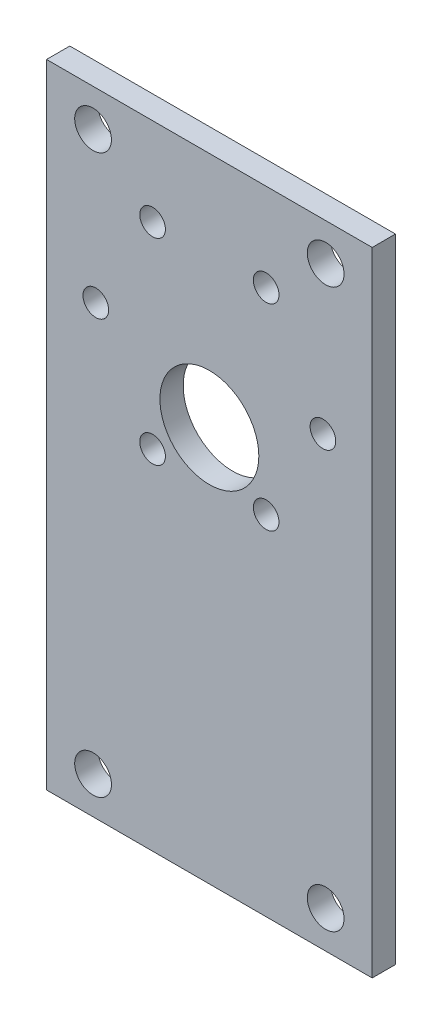
ISO-10303-21;
HEADER;
FILE_DESCRIPTION(('STEP AP214'),'2;1');
FILE_NAME('part.step','',(''),(''),'','','');
FILE_SCHEMA(('AUTOMOTIVE_DESIGN { 1 0 10303 214 1 1 1 1 }'));
ENDSEC;
DATA;
#1=APPLICATION_CONTEXT('core data for automotive mechanical design processes');
#2=APPLICATION_PROTOCOL_DEFINITION('international standard','automotive_design',2000,#1);
#3=PRODUCT_CONTEXT('',#1,'mechanical');
#4=PRODUCT('Part','Part','',(#3));
#5=PRODUCT_RELATED_PRODUCT_CATEGORY('part','',(#4));
#6=PRODUCT_DEFINITION_FORMATION('','',#4);
#7=PRODUCT_DEFINITION_CONTEXT('part definition',#1,'design');
#8=PRODUCT_DEFINITION('design','',#6,#7);
#9=PRODUCT_DEFINITION_SHAPE('','',#8);
#10=(LENGTH_UNIT() NAMED_UNIT(*) SI_UNIT(.MILLI.,.METRE.));
#11=(NAMED_UNIT(*) PLANE_ANGLE_UNIT() SI_UNIT($,.RADIAN.));
#12=(NAMED_UNIT(*) SI_UNIT($,.STERADIAN.) SOLID_ANGLE_UNIT());
#13=UNCERTAINTY_MEASURE_WITH_UNIT(LENGTH_MEASURE(1.E-05),#10,'distance_accuracy_value','');
#14=(GEOMETRIC_REPRESENTATION_CONTEXT(3) GLOBAL_UNCERTAINTY_ASSIGNED_CONTEXT((#13)) GLOBAL_UNIT_ASSIGNED_CONTEXT((#10,
#11,#12)) REPRESENTATION_CONTEXT('',''));
#15=CARTESIAN_POINT('',(0.,0.,0.));
#16=DIRECTION('',(0.,0.,1.));
#17=DIRECTION('',(1.,0.,0.));
#18=AXIS2_PLACEMENT_3D('',#15,#16,#17);
#19=CARTESIAN_POINT('',(0.,0.,3.175));
#20=DIRECTION('',(0.,0.,-1.));
#21=DIRECTION('',(-1.,0.,0.));
#22=AXIS2_PLACEMENT_3D('',#19,#20,#21);
#23=PLANE('',#22);
#24=DIRECTION('',(0.,1.,0.));
#25=VECTOR('',#24,1.);
#26=CARTESIAN_POINT('',(-82.2462417962218,78.4842711459143,3.175));
#27=LINE('',#26,#25);
#28=CARTESIAN_POINT('',(-82.2462417962218,-7.87572885408564,3.175));
#29=VERTEX_POINT('',#28);
#30=CARTESIAN_POINT('',(-82.2462417962218,78.4842711459143,3.175));
#31=VERTEX_POINT('',#30);
#32=EDGE_CURVE('E51',#29,#31,#27,.T.);
#33=ORIENTED_EDGE('',*,*,#32,.T.);
#34=DIRECTION('',(-1.,0.,0.));
#35=VECTOR('',#34,1.);
#36=CARTESIAN_POINT('',(-82.2462417962218,78.4842711459143,3.175));
#37=LINE('',#36,#35);
#38=CARTESIAN_POINT('',(-126.696241796222,78.4842711459143,3.175));
#39=VERTEX_POINT('',#38);
#40=EDGE_CURVE('E81',#31,#39,#37,.T.);
#41=ORIENTED_EDGE('',*,*,#40,.T.);
#42=DIRECTION('',(0.,-1.,0.));
#43=VECTOR('',#42,1.);
#44=CARTESIAN_POINT('',(-126.696241796222,78.4842711459143,3.175));
#45=LINE('',#44,#43);
#46=CARTESIAN_POINT('',(-126.696241796222,-7.87572885408565,3.175));
#47=VERTEX_POINT('',#46);
#48=EDGE_CURVE('E85',#39,#47,#45,.T.);
#49=ORIENTED_EDGE('',*,*,#48,.T.);
#50=DIRECTION('',(1.,0.,0.));
#51=VECTOR('',#50,1.);
#52=CARTESIAN_POINT('',(-82.2462417962218,-7.87572885408564,3.175));
#53=LINE('',#52,#51);
#54=EDGE_CURVE('E93',#47,#29,#53,.T.);
#55=ORIENTED_EDGE('',*,*,#54,.T.);
#56=EDGE_LOOP('',(#33,#41,#49,#55));
#57=FACE_BOUND('',#56,.T.);
#58=CARTESIAN_POINT('',(-119.971241796222,53.0842711459143,3.175));
#59=DIRECTION('',(0.,0.,1.));
#60=DIRECTION('',(1.,0.,0.));
#61=AXIS2_PLACEMENT_3D('',#58,#59,#60);
#62=CIRCLE('',#61,1.75);
#63=CARTESIAN_POINT('',(-118.221241796222,53.0842711459143,3.175));
#64=VERTEX_POINT('',#63);
#65=EDGE_CURVE('E100',#64,#64,#62,.T.);
#66=ORIENTED_EDGE('',*,*,#65,.F.);
#67=EDGE_LOOP('',(#66));
#68=FACE_BOUND('',#67,.T.);
#69=CARTESIAN_POINT('',(-112.221241796222,66.5076649045731,3.175));
#70=DIRECTION('',(0.,0.,1.));
#71=DIRECTION('',(1.,0.,0.));
#72=AXIS2_PLACEMENT_3D('',#69,#70,#71);
#73=CIRCLE('',#72,1.75000000000001);
#74=CARTESIAN_POINT('',(-110.471241796222,66.5076649045731,3.175));
#75=VERTEX_POINT('',#74);
#76=EDGE_CURVE('E231',#75,#75,#73,.T.);
#77=ORIENTED_EDGE('',*,*,#76,.F.);
#78=EDGE_LOOP('',(#77));
#79=FACE_BOUND('',#78,.T.);
#80=CARTESIAN_POINT('',(-112.221241796222,39.6608773872556,3.175));
#81=DIRECTION('',(0.,0.,1.));
#82=DIRECTION('',(1.,0.,0.));
#83=AXIS2_PLACEMENT_3D('',#80,#81,#82);
#84=CIRCLE('',#83,1.75);
#85=CARTESIAN_POINT('',(-110.471241796222,39.6608773872556,3.175));
#86=VERTEX_POINT('',#85);
#87=EDGE_CURVE('E225',#86,#86,#84,.T.);
#88=ORIENTED_EDGE('',*,*,#87,.F.);
#89=EDGE_LOOP('',(#88));
#90=FACE_BOUND('',#89,.T.);
#91=CARTESIAN_POINT('',(-96.7212417962218,39.6608773872556,3.175));
#92=DIRECTION('',(0.,0.,1.));
#93=DIRECTION('',(1.,0.,0.));
#94=AXIS2_PLACEMENT_3D('',#91,#92,#93);
#95=CIRCLE('',#94,1.75);
#96=CARTESIAN_POINT('',(-94.9712417962218,39.6608773872556,3.175));
#97=VERTEX_POINT('',#96);
#98=EDGE_CURVE('E219',#97,#97,#95,.T.);
#99=ORIENTED_EDGE('',*,*,#98,.F.);
#100=EDGE_LOOP('',(#99));
#101=FACE_BOUND('',#100,.T.);
#102=CARTESIAN_POINT('',(-88.9712417962218,53.0842711459144,3.175));
#103=DIRECTION('',(0.,0.,1.));
#104=DIRECTION('',(1.,0.,0.));
#105=AXIS2_PLACEMENT_3D('',#102,#103,#104);
#106=CIRCLE('',#105,1.75);
#107=CARTESIAN_POINT('',(-87.2212417962218,53.0842711459144,3.175));
#108=VERTEX_POINT('',#107);
#109=EDGE_CURVE('E213',#108,#108,#106,.T.);
#110=ORIENTED_EDGE('',*,*,#109,.F.);
#111=EDGE_LOOP('',(#110));
#112=FACE_BOUND('',#111,.T.);
#113=CARTESIAN_POINT('',(-96.7212417962218,66.5076649045731,3.175));
#114=DIRECTION('',(0.,0.,1.));
#115=DIRECTION('',(1.,0.,0.));
#116=AXIS2_PLACEMENT_3D('',#113,#114,#115);
#117=CIRCLE('',#116,1.75000000000003);
#118=CARTESIAN_POINT('',(-94.9712417962218,66.5076649045731,3.175));
#119=VERTEX_POINT('',#118);
#120=EDGE_CURVE('E207',#119,#119,#117,.T.);
#121=ORIENTED_EDGE('',*,*,#120,.F.);
#122=EDGE_LOOP('',(#121));
#123=FACE_BOUND('',#122,.T.);
#124=CARTESIAN_POINT('',(-104.471241796222,46.0842597459143,3.175));
#125=DIRECTION('',(0.,0.,1.));
#126=DIRECTION('',(1.,0.,0.));
#127=AXIS2_PLACEMENT_3D('',#124,#125,#126);
#128=CIRCLE('',#127,6.75);
#129=CARTESIAN_POINT('',(-97.7212417962218,46.0842597459143,3.175));
#130=VERTEX_POINT('',#129);
#131=EDGE_CURVE('E201',#130,#130,#128,.T.);
#132=ORIENTED_EDGE('',*,*,#131,.F.);
#133=EDGE_LOOP('',(#132));
#134=FACE_BOUND('',#133,.T.);
#135=CARTESIAN_POINT('',(-120.346241796222,73.4042711459143,3.175));
#136=DIRECTION('',(0.,0.,1.));
#137=DIRECTION('',(1.,0.,0.));
#138=AXIS2_PLACEMENT_3D('',#135,#136,#137);
#139=CIRCLE('',#138,2.50825);
#140=CARTESIAN_POINT('',(-117.837991796222,73.4042711459143,3.175));
#141=VERTEX_POINT('',#140);
#142=EDGE_CURVE('E195',#141,#141,#139,.T.);
#143=ORIENTED_EDGE('',*,*,#142,.F.);
#144=EDGE_LOOP('',(#143));
#145=FACE_BOUND('',#144,.T.);
#146=CARTESIAN_POINT('',(-88.5962417962218,73.4042711459143,3.175));
#147=DIRECTION('',(0.,0.,1.));
#148=DIRECTION('',(1.,0.,0.));
#149=AXIS2_PLACEMENT_3D('',#146,#147,#148);
#150=CIRCLE('',#149,2.50825);
#151=CARTESIAN_POINT('',(-86.0879917962218,73.4042711459143,3.175));
#152=VERTEX_POINT('',#151);
#153=EDGE_CURVE('E189',#152,#152,#150,.T.);
#154=ORIENTED_EDGE('',*,*,#153,.F.);
#155=EDGE_LOOP('',(#154));
#156=FACE_BOUND('',#155,.T.);
#157=CARTESIAN_POINT('',(-88.5962417962218,-2.79572885408564,3.175));
#158=DIRECTION('',(0.,0.,1.));
#159=DIRECTION('',(1.,0.,0.));
#160=AXIS2_PLACEMENT_3D('',#157,#158,#159);
#161=CIRCLE('',#160,2.50825000000001);
#162=CARTESIAN_POINT('',(-86.0879917962218,-2.79572885408564,3.175));
#163=VERTEX_POINT('',#162);
#164=EDGE_CURVE('E183',#163,#163,#161,.T.);
#165=ORIENTED_EDGE('',*,*,#164,.F.);
#166=EDGE_LOOP('',(#165));
#167=FACE_BOUND('',#166,.T.);
#168=CARTESIAN_POINT('',(-120.346241796222,-2.79572885408564,3.175));
#169=DIRECTION('',(0.,0.,1.));
#170=DIRECTION('',(1.,0.,0.));
#171=AXIS2_PLACEMENT_3D('',#168,#169,#170);
#172=CIRCLE('',#171,2.50825000000001);
#173=CARTESIAN_POINT('',(-117.837991796222,-2.79572885408564,3.175));
#174=VERTEX_POINT('',#173);
#175=EDGE_CURVE('E174',#174,#174,#172,.T.);
#176=ORIENTED_EDGE('',*,*,#175,.F.);
#177=EDGE_LOOP('',(#176));
#178=FACE_BOUND('',#177,.T.);
#179=ADVANCED_FACE('F34',(#57,#68,#79,#90,#101,#112,#123,#134,#145,#156,#167,#178),#23,.F.);
#180=CARTESIAN_POINT('',(0.,0.,0.));
#181=DIRECTION('',(0.,0.,-1.));
#182=DIRECTION('',(-1.,0.,0.));
#183=AXIS2_PLACEMENT_3D('',#180,#181,#182);
#184=PLANE('',#183);
#185=CARTESIAN_POINT('',(-88.5962417962218,-2.79572885408564,0.));
#186=DIRECTION('',(0.,0.,1.));
#187=DIRECTION('',(1.,0.,0.));
#188=AXIS2_PLACEMENT_3D('',#185,#186,#187);
#189=CIRCLE('',#188,2.50825000000001);
#190=CARTESIAN_POINT('',(-86.0879917962218,-2.79572885408564,0.));
#191=VERTEX_POINT('',#190);
#192=EDGE_CURVE('E180',#191,#191,#189,.T.);
#193=ORIENTED_EDGE('',*,*,#192,.T.);
#194=EDGE_LOOP('',(#193));
#195=FACE_BOUND('',#194,.T.);
#196=CARTESIAN_POINT('',(-120.346241796222,73.4042711459143,0.));
#197=DIRECTION('',(0.,0.,1.));
#198=DIRECTION('',(1.,0.,0.));
#199=AXIS2_PLACEMENT_3D('',#196,#197,#198);
#200=CIRCLE('',#199,2.50825);
#201=CARTESIAN_POINT('',(-117.837991796222,73.4042711459143,0.));
#202=VERTEX_POINT('',#201);
#203=EDGE_CURVE('E192',#202,#202,#200,.T.);
#204=ORIENTED_EDGE('',*,*,#203,.T.);
#205=EDGE_LOOP('',(#204));
#206=FACE_BOUND('',#205,.T.);
#207=CARTESIAN_POINT('',(-96.7212417962218,66.5076649045731,0.));
#208=DIRECTION('',(0.,0.,1.));
#209=DIRECTION('',(1.,0.,0.));
#210=AXIS2_PLACEMENT_3D('',#207,#208,#209);
#211=CIRCLE('',#210,1.75000000000003);
#212=CARTESIAN_POINT('',(-94.9712417962218,66.5076649045731,0.));
#213=VERTEX_POINT('',#212);
#214=EDGE_CURVE('E204',#213,#213,#211,.T.);
#215=ORIENTED_EDGE('',*,*,#214,.T.);
#216=EDGE_LOOP('',(#215));
#217=FACE_BOUND('',#216,.T.);
#218=CARTESIAN_POINT('',(-96.7212417962218,39.6608773872556,0.));
#219=DIRECTION('',(0.,0.,1.));
#220=DIRECTION('',(1.,0.,0.));
#221=AXIS2_PLACEMENT_3D('',#218,#219,#220);
#222=CIRCLE('',#221,1.75);
#223=CARTESIAN_POINT('',(-94.9712417962218,39.6608773872556,0.));
#224=VERTEX_POINT('',#223);
#225=EDGE_CURVE('E216',#224,#224,#222,.T.);
#226=ORIENTED_EDGE('',*,*,#225,.T.);
#227=EDGE_LOOP('',(#226));
#228=FACE_BOUND('',#227,.T.);
#229=CARTESIAN_POINT('',(-112.221241796222,66.5076649045731,0.));
#230=DIRECTION('',(0.,0.,1.));
#231=DIRECTION('',(1.,0.,0.));
#232=AXIS2_PLACEMENT_3D('',#229,#230,#231);
#233=CIRCLE('',#232,1.75000000000001);
#234=CARTESIAN_POINT('',(-110.471241796222,66.5076649045731,0.));
#235=VERTEX_POINT('',#234);
#236=EDGE_CURVE('E228',#235,#235,#233,.T.);
#237=ORIENTED_EDGE('',*,*,#236,.T.);
#238=EDGE_LOOP('',(#237));
#239=FACE_BOUND('',#238,.T.);
#240=DIRECTION('',(-1.,0.,0.));
#241=VECTOR('',#240,1.);
#242=CARTESIAN_POINT('',(-82.2462417962218,78.4842711459143,0.));
#243=LINE('',#242,#241);
#244=CARTESIAN_POINT('',(-82.2462417962218,78.4842711459143,0.));
#245=VERTEX_POINT('',#244);
#246=CARTESIAN_POINT('',(-126.696241796222,78.4842711459143,0.));
#247=VERTEX_POINT('',#246);
#248=EDGE_CURVE('E89',#245,#247,#243,.T.);
#249=ORIENTED_EDGE('',*,*,#248,.F.);
#250=DIRECTION('',(0.,1.,0.));
#251=VECTOR('',#250,1.);
#252=CARTESIAN_POINT('',(-82.2462417962218,27.6842711459144,0.));
#253=LINE('',#252,#251);
#254=CARTESIAN_POINT('',(-82.2462417962218,-7.87572885408564,0.));
#255=VERTEX_POINT('',#254);
#256=EDGE_CURVE('E103',#255,#245,#253,.T.);
#257=ORIENTED_EDGE('',*,*,#256,.F.);
#258=DIRECTION('',(1.,0.,0.));
#259=VECTOR('',#258,1.);
#260=CARTESIAN_POINT('',(-82.2462417962218,-7.87572885408564,0.));
#261=LINE('',#260,#259);
#262=CARTESIAN_POINT('',(-126.696241796222,-7.87572885408565,0.));
#263=VERTEX_POINT('',#262);
#264=EDGE_CURVE('E75',#263,#255,#261,.T.);
#265=ORIENTED_EDGE('',*,*,#264,.F.);
#266=DIRECTION('',(0.,-1.,0.));
#267=VECTOR('',#266,1.);
#268=CARTESIAN_POINT('',(-126.696241796222,27.6842711459143,0.));
#269=LINE('',#268,#267);
#270=EDGE_CURVE('E68',#247,#263,#269,.T.);
#271=ORIENTED_EDGE('',*,*,#270,.F.);
#272=EDGE_LOOP('',(#249,#257,#265,#271));
#273=FACE_BOUND('',#272,.T.);
#274=CARTESIAN_POINT('',(-119.971241796222,53.0842711459143,0.));
#275=DIRECTION('',(0.,0.,1.));
#276=DIRECTION('',(1.,0.,0.));
#277=AXIS2_PLACEMENT_3D('',#274,#275,#276);
#278=CIRCLE('',#277,1.75);
#279=CARTESIAN_POINT('',(-118.221241796222,53.0842711459143,0.));
#280=VERTEX_POINT('',#279);
#281=EDGE_CURVE('E234',#280,#280,#278,.T.);
#282=ORIENTED_EDGE('',*,*,#281,.T.);
#283=EDGE_LOOP('',(#282));
#284=FACE_BOUND('',#283,.T.);
#285=CARTESIAN_POINT('',(-112.221241796222,39.6608773872556,0.));
#286=DIRECTION('',(0.,0.,1.));
#287=DIRECTION('',(1.,0.,0.));
#288=AXIS2_PLACEMENT_3D('',#285,#286,#287);
#289=CIRCLE('',#288,1.75);
#290=CARTESIAN_POINT('',(-110.471241796222,39.6608773872556,0.));
#291=VERTEX_POINT('',#290);
#292=EDGE_CURVE('E222',#291,#291,#289,.T.);
#293=ORIENTED_EDGE('',*,*,#292,.T.);
#294=EDGE_LOOP('',(#293));
#295=FACE_BOUND('',#294,.T.);
#296=CARTESIAN_POINT('',(-88.9712417962218,53.0842711459144,0.));
#297=DIRECTION('',(0.,0.,1.));
#298=DIRECTION('',(1.,0.,0.));
#299=AXIS2_PLACEMENT_3D('',#296,#297,#298);
#300=CIRCLE('',#299,1.75);
#301=CARTESIAN_POINT('',(-87.2212417962218,53.0842711459144,0.));
#302=VERTEX_POINT('',#301);
#303=EDGE_CURVE('E210',#302,#302,#300,.T.);
#304=ORIENTED_EDGE('',*,*,#303,.T.);
#305=EDGE_LOOP('',(#304));
#306=FACE_BOUND('',#305,.T.);
#307=CARTESIAN_POINT('',(-104.471241796222,46.0842597459143,0.));
#308=DIRECTION('',(0.,0.,1.));
#309=DIRECTION('',(1.,0.,0.));
#310=AXIS2_PLACEMENT_3D('',#307,#308,#309);
#311=CIRCLE('',#310,6.75);
#312=CARTESIAN_POINT('',(-97.7212417962218,46.0842597459143,0.));
#313=VERTEX_POINT('',#312);
#314=EDGE_CURVE('E198',#313,#313,#311,.T.);
#315=ORIENTED_EDGE('',*,*,#314,.T.);
#316=EDGE_LOOP('',(#315));
#317=FACE_BOUND('',#316,.T.);
#318=CARTESIAN_POINT('',(-88.5962417962218,73.4042711459143,0.));
#319=DIRECTION('',(0.,0.,1.));
#320=DIRECTION('',(1.,0.,0.));
#321=AXIS2_PLACEMENT_3D('',#318,#319,#320);
#322=CIRCLE('',#321,2.50825);
#323=CARTESIAN_POINT('',(-86.0879917962218,73.4042711459143,0.));
#324=VERTEX_POINT('',#323);
#325=EDGE_CURVE('E186',#324,#324,#322,.T.);
#326=ORIENTED_EDGE('',*,*,#325,.T.);
#327=EDGE_LOOP('',(#326));
#328=FACE_BOUND('',#327,.T.);
#329=CARTESIAN_POINT('',(-120.346241796222,-2.79572885408564,0.));
#330=DIRECTION('',(0.,0.,1.));
#331=DIRECTION('',(1.,0.,0.));
#332=AXIS2_PLACEMENT_3D('',#329,#330,#331);
#333=CIRCLE('',#332,2.50825000000001);
#334=CARTESIAN_POINT('',(-117.837991796222,-2.79572885408564,0.));
#335=VERTEX_POINT('',#334);
#336=EDGE_CURVE('E177',#335,#335,#333,.T.);
#337=ORIENTED_EDGE('',*,*,#336,.T.);
#338=EDGE_LOOP('',(#337));
#339=FACE_BOUND('',#338,.T.);
#340=ADVANCED_FACE('F109',(#195,#206,#217,#228,#239,#273,#284,#295,#306,#317,#328,#339),#184,.T.);
#341=CARTESIAN_POINT('',(-82.2462417962218,78.4842711459143,3.175));
#342=DIRECTION('',(0.,-1.,0.));
#343=DIRECTION('',(0.,0.,-1.));
#344=AXIS2_PLACEMENT_3D('',#341,#342,#343);
#345=PLANE('',#344);
#346=ORIENTED_EDGE('',*,*,#248,.T.);
#347=DIRECTION('',(0.,0.,-1.));
#348=VECTOR('',#347,1.);
#349=CARTESIAN_POINT('',(-126.696241796222,78.4842711459143,3.175));
#350=LINE('',#349,#348);
#351=EDGE_CURVE('E43',#39,#247,#350,.T.);
#352=ORIENTED_EDGE('',*,*,#351,.F.);
#353=ORIENTED_EDGE('',*,*,#40,.F.);
#354=DIRECTION('',(0.,0.,-1.));
#355=VECTOR('',#354,1.);
#356=CARTESIAN_POINT('',(-82.2462417962218,78.4842711459143,3.175));
#357=LINE('',#356,#355);
#358=EDGE_CURVE('E11',#31,#245,#357,.T.);
#359=ORIENTED_EDGE('',*,*,#358,.T.);
#360=EDGE_LOOP('',(#346,#352,#353,#359));
#361=FACE_BOUND('',#360,.T.);
#362=ADVANCED_FACE('F36',(#361),#345,.F.);
#363=CARTESIAN_POINT('',(-126.696241796222,27.6842711459143,3.175));
#364=DIRECTION('',(1.,0.,0.));
#365=DIRECTION('',(0.,0.,-1.));
#366=AXIS2_PLACEMENT_3D('',#363,#364,#365);
#367=PLANE('',#366);
#368=ORIENTED_EDGE('',*,*,#270,.T.);
#369=DIRECTION('',(0.,0.,-1.));
#370=VECTOR('',#369,1.);
#371=CARTESIAN_POINT('',(-126.696241796222,-7.87572885408565,3.175));
#372=LINE('',#371,#370);
#373=EDGE_CURVE('E90',#47,#263,#372,.T.);
#374=ORIENTED_EDGE('',*,*,#373,.F.);
#375=ORIENTED_EDGE('',*,*,#48,.F.);
#376=ORIENTED_EDGE('',*,*,#351,.T.);
#377=EDGE_LOOP('',(#368,#374,#375,#376));
#378=FACE_BOUND('',#377,.T.);
#379=ADVANCED_FACE('F91',(#378),#367,.F.);
#380=CARTESIAN_POINT('',(-82.2462417962218,-7.87572885408564,3.175));
#381=DIRECTION('',(0.,1.,0.));
#382=DIRECTION('',(-1.,0.,0.));
#383=AXIS2_PLACEMENT_3D('',#380,#381,#382);
#384=PLANE('',#383);
#385=ORIENTED_EDGE('',*,*,#264,.T.);
#386=DIRECTION('',(0.,0.,-1.));
#387=VECTOR('',#386,1.);
#388=CARTESIAN_POINT('',(-82.2462417962218,-7.87572885408564,3.175));
#389=LINE('',#388,#387);
#390=EDGE_CURVE('E95',#29,#255,#389,.T.);
#391=ORIENTED_EDGE('',*,*,#390,.F.);
#392=ORIENTED_EDGE('',*,*,#54,.F.);
#393=ORIENTED_EDGE('',*,*,#373,.T.);
#394=EDGE_LOOP('',(#385,#391,#392,#393));
#395=FACE_BOUND('',#394,.T.);
#396=ADVANCED_FACE('F106',(#395),#384,.F.);
#397=CARTESIAN_POINT('',(-82.2462417962218,27.6842711459144,3.175));
#398=DIRECTION('',(-1.,0.,0.));
#399=DIRECTION('',(0.,-1.,0.));
#400=AXIS2_PLACEMENT_3D('',#397,#398,#399);
#401=PLANE('',#400);
#402=ORIENTED_EDGE('',*,*,#256,.T.);
#403=ORIENTED_EDGE('',*,*,#358,.F.);
#404=ORIENTED_EDGE('',*,*,#32,.F.);
#405=ORIENTED_EDGE('',*,*,#390,.T.);
#406=EDGE_LOOP('',(#402,#403,#404,#405));
#407=FACE_BOUND('',#406,.T.);
#408=ADVANCED_FACE('F111',(#407),#401,.F.);
#409=CARTESIAN_POINT('',(-119.971241796222,53.0842711459143,3.175));
#410=DIRECTION('',(0.,0.,-1.));
#411=DIRECTION('',(-1.,0.,0.));
#412=AXIS2_PLACEMENT_3D('',#409,#410,#411);
#413=CYLINDRICAL_SURFACE('',#412,1.75);
#414=ORIENTED_EDGE('',*,*,#65,.T.);
#415=EDGE_LOOP('',(#414));
#416=FACE_BOUND('',#415,.T.);
#417=ORIENTED_EDGE('',*,*,#281,.F.);
#418=EDGE_LOOP('',(#417));
#419=FACE_BOUND('',#418,.T.);
#420=ADVANCED_FACE('F113',(#416,#419),#413,.F.);
#421=CARTESIAN_POINT('',(-112.221241796222,66.5076649045731,3.175));
#422=DIRECTION('',(0.,0.,-1.));
#423=DIRECTION('',(-1.,0.,0.));
#424=AXIS2_PLACEMENT_3D('',#421,#422,#423);
#425=CYLINDRICAL_SURFACE('',#424,1.75000000000001);
#426=ORIENTED_EDGE('',*,*,#76,.T.);
#427=EDGE_LOOP('',(#426));
#428=FACE_BOUND('',#427,.T.);
#429=ORIENTED_EDGE('',*,*,#236,.F.);
#430=EDGE_LOOP('',(#429));
#431=FACE_BOUND('',#430,.T.);
#432=ADVANCED_FACE('F119',(#428,#431),#425,.F.);
#433=CARTESIAN_POINT('',(-112.221241796222,39.6608773872556,3.175));
#434=DIRECTION('',(0.,0.,-1.));
#435=DIRECTION('',(-1.,0.,0.));
#436=AXIS2_PLACEMENT_3D('',#433,#434,#435);
#437=CYLINDRICAL_SURFACE('',#436,1.75);
#438=ORIENTED_EDGE('',*,*,#87,.T.);
#439=EDGE_LOOP('',(#438));
#440=FACE_BOUND('',#439,.T.);
#441=ORIENTED_EDGE('',*,*,#292,.F.);
#442=EDGE_LOOP('',(#441));
#443=FACE_BOUND('',#442,.T.);
#444=ADVANCED_FACE('F133',(#440,#443),#437,.F.);
#445=CARTESIAN_POINT('',(-96.7212417962218,39.6608773872556,3.175));
#446=DIRECTION('',(0.,0.,-1.));
#447=DIRECTION('',(-1.,0.,0.));
#448=AXIS2_PLACEMENT_3D('',#445,#446,#447);
#449=CYLINDRICAL_SURFACE('',#448,1.75);
#450=ORIENTED_EDGE('',*,*,#98,.T.);
#451=EDGE_LOOP('',(#450));
#452=FACE_BOUND('',#451,.T.);
#453=ORIENTED_EDGE('',*,*,#225,.F.);
#454=EDGE_LOOP('',(#453));
#455=FACE_BOUND('',#454,.T.);
#456=ADVANCED_FACE('F137',(#452,#455),#449,.F.);
#457=CARTESIAN_POINT('',(-88.9712417962218,53.0842711459144,3.175));
#458=DIRECTION('',(0.,0.,-1.));
#459=DIRECTION('',(-1.,0.,0.));
#460=AXIS2_PLACEMENT_3D('',#457,#458,#459);
#461=CYLINDRICAL_SURFACE('',#460,1.75);
#462=ORIENTED_EDGE('',*,*,#109,.T.);
#463=EDGE_LOOP('',(#462));
#464=FACE_BOUND('',#463,.T.);
#465=ORIENTED_EDGE('',*,*,#303,.F.);
#466=EDGE_LOOP('',(#465));
#467=FACE_BOUND('',#466,.T.);
#468=ADVANCED_FACE('F141',(#464,#467),#461,.F.);
#469=CARTESIAN_POINT('',(-96.7212417962218,66.5076649045731,3.175));
#470=DIRECTION('',(0.,0.,-1.));
#471=DIRECTION('',(-1.,0.,0.));
#472=AXIS2_PLACEMENT_3D('',#469,#470,#471);
#473=CYLINDRICAL_SURFACE('',#472,1.75000000000003);
#474=ORIENTED_EDGE('',*,*,#120,.T.);
#475=EDGE_LOOP('',(#474));
#476=FACE_BOUND('',#475,.T.);
#477=ORIENTED_EDGE('',*,*,#214,.F.);
#478=EDGE_LOOP('',(#477));
#479=FACE_BOUND('',#478,.T.);
#480=ADVANCED_FACE('F145',(#476,#479),#473,.F.);
#481=CARTESIAN_POINT('',(-104.471241796222,46.0842597459143,3.175));
#482=DIRECTION('',(0.,0.,-1.));
#483=DIRECTION('',(-1.,0.,0.));
#484=AXIS2_PLACEMENT_3D('',#481,#482,#483);
#485=CYLINDRICAL_SURFACE('',#484,6.75);
#486=ORIENTED_EDGE('',*,*,#131,.T.);
#487=EDGE_LOOP('',(#486));
#488=FACE_BOUND('',#487,.T.);
#489=ORIENTED_EDGE('',*,*,#314,.F.);
#490=EDGE_LOOP('',(#489));
#491=FACE_BOUND('',#490,.T.);
#492=ADVANCED_FACE('F149',(#488,#491),#485,.F.);
#493=CARTESIAN_POINT('',(-120.346241796222,73.4042711459143,3.175));
#494=DIRECTION('',(0.,0.,-1.));
#495=DIRECTION('',(-1.,0.,0.));
#496=AXIS2_PLACEMENT_3D('',#493,#494,#495);
#497=CYLINDRICAL_SURFACE('',#496,2.50825);
#498=ORIENTED_EDGE('',*,*,#142,.T.);
#499=EDGE_LOOP('',(#498));
#500=FACE_BOUND('',#499,.T.);
#501=ORIENTED_EDGE('',*,*,#203,.F.);
#502=EDGE_LOOP('',(#501));
#503=FACE_BOUND('',#502,.T.);
#504=ADVANCED_FACE('F153',(#500,#503),#497,.F.);
#505=CARTESIAN_POINT('',(-88.5962417962218,73.4042711459143,3.175));
#506=DIRECTION('',(0.,0.,-1.));
#507=DIRECTION('',(-1.,0.,0.));
#508=AXIS2_PLACEMENT_3D('',#505,#506,#507);
#509=CYLINDRICAL_SURFACE('',#508,2.50825);
#510=ORIENTED_EDGE('',*,*,#153,.T.);
#511=EDGE_LOOP('',(#510));
#512=FACE_BOUND('',#511,.T.);
#513=ORIENTED_EDGE('',*,*,#325,.F.);
#514=EDGE_LOOP('',(#513));
#515=FACE_BOUND('',#514,.T.);
#516=ADVANCED_FACE('F157',(#512,#515),#509,.F.);
#517=CARTESIAN_POINT('',(-88.5962417962218,-2.79572885408564,3.175));
#518=DIRECTION('',(0.,0.,-1.));
#519=DIRECTION('',(-1.,0.,0.));
#520=AXIS2_PLACEMENT_3D('',#517,#518,#519);
#521=CYLINDRICAL_SURFACE('',#520,2.50825000000001);
#522=ORIENTED_EDGE('',*,*,#164,.T.);
#523=EDGE_LOOP('',(#522));
#524=FACE_BOUND('',#523,.T.);
#525=ORIENTED_EDGE('',*,*,#192,.F.);
#526=EDGE_LOOP('',(#525));
#527=FACE_BOUND('',#526,.T.);
#528=ADVANCED_FACE('F161',(#524,#527),#521,.F.);
#529=CARTESIAN_POINT('',(-120.346241796222,-2.79572885408564,3.175));
#530=DIRECTION('',(0.,0.,-1.));
#531=DIRECTION('',(-1.,0.,0.));
#532=AXIS2_PLACEMENT_3D('',#529,#530,#531);
#533=CYLINDRICAL_SURFACE('',#532,2.50825000000001);
#534=ORIENTED_EDGE('',*,*,#175,.T.);
#535=EDGE_LOOP('',(#534));
#536=FACE_BOUND('',#535,.T.);
#537=ORIENTED_EDGE('',*,*,#336,.F.);
#538=EDGE_LOOP('',(#537));
#539=FACE_BOUND('',#538,.T.);
#540=ADVANCED_FACE('F165',(#536,#539),#533,.F.);
#541=CLOSED_SHELL('',(#179,#340,#362,#379,#396,#408,#420,#432,#444,#456,#468,#480,#492,#504,
#516,#528,#540));
#542=MANIFOLD_SOLID_BREP('B2',#541);
#543=ADVANCED_BREP_SHAPE_REPRESENTATION('',(#18,#542),#14);
#544=SHAPE_DEFINITION_REPRESENTATION(#9,#543);
ENDSEC;
END-ISO-10303-21;
